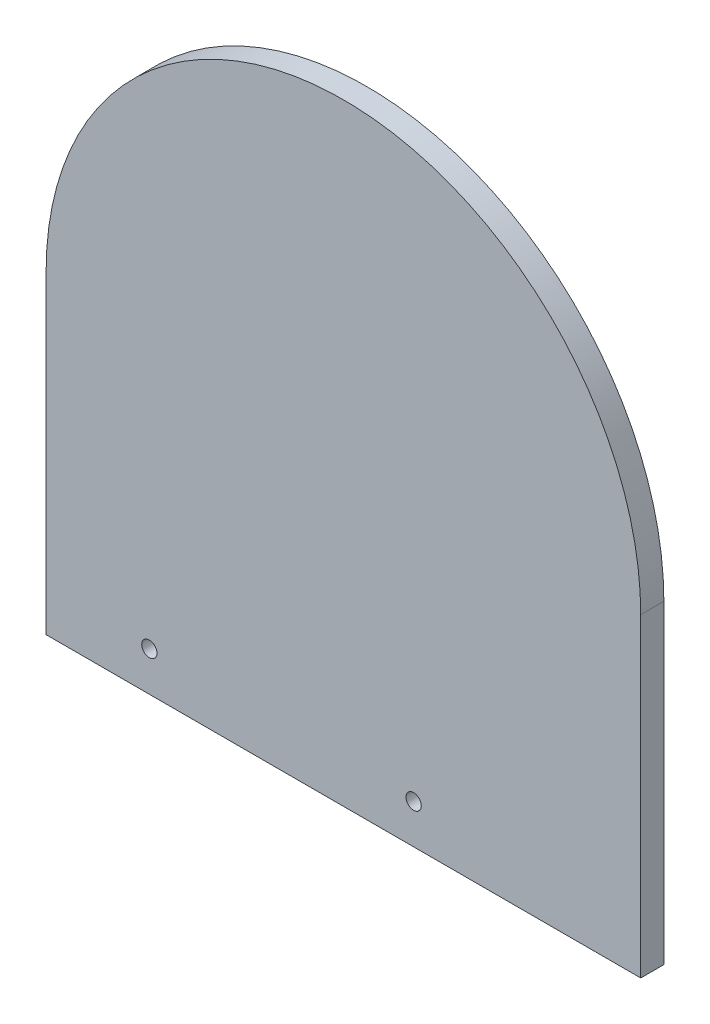
ISO-10303-21;
HEADER;
FILE_DESCRIPTION(('STEP AP214'),'2;1');
FILE_NAME('part.step','',(''),(''),'','','');
FILE_SCHEMA(('AUTOMOTIVE_DESIGN { 1 0 10303 214 1 1 1 1 }'));
ENDSEC;
DATA;
#1=APPLICATION_CONTEXT('core data for automotive mechanical design processes');
#2=APPLICATION_PROTOCOL_DEFINITION('international standard','automotive_design',2000,#1);
#3=PRODUCT_CONTEXT('',#1,'mechanical');
#4=PRODUCT('Part','Part','',(#3));
#5=PRODUCT_RELATED_PRODUCT_CATEGORY('part','',(#4));
#6=PRODUCT_DEFINITION_FORMATION('','',#4);
#7=PRODUCT_DEFINITION_CONTEXT('part definition',#1,'design');
#8=PRODUCT_DEFINITION('design','',#6,#7);
#9=PRODUCT_DEFINITION_SHAPE('','',#8);
#10=(LENGTH_UNIT() NAMED_UNIT(*) SI_UNIT(.MILLI.,.METRE.));
#11=(NAMED_UNIT(*) PLANE_ANGLE_UNIT() SI_UNIT($,.RADIAN.));
#12=(NAMED_UNIT(*) SI_UNIT($,.STERADIAN.) SOLID_ANGLE_UNIT());
#13=UNCERTAINTY_MEASURE_WITH_UNIT(LENGTH_MEASURE(1.E-05),#10,'distance_accuracy_value','');
#14=(GEOMETRIC_REPRESENTATION_CONTEXT(3) GLOBAL_UNCERTAINTY_ASSIGNED_CONTEXT((#13)) GLOBAL_UNIT_ASSIGNED_CONTEXT((#10,
#11,#12)) REPRESENTATION_CONTEXT('',''));
#15=CARTESIAN_POINT('',(0.,0.,0.));
#16=DIRECTION('',(0.,0.,1.));
#17=DIRECTION('',(1.,0.,0.));
#18=AXIS2_PLACEMENT_3D('',#15,#16,#17);
#19=CARTESIAN_POINT('',(0.,76.2,5.6));
#20=DIRECTION('',(0.,0.,-1.));
#21=DIRECTION('',(-1.,0.,0.));
#22=AXIS2_PLACEMENT_3D('',#19,#20,#21);
#23=PLANE('',#22);
#24=DIRECTION('',(0.,-1.,0.));
#25=VECTOR('',#24,1.);
#26=CARTESIAN_POINT('',(-72.,0.,5.6));
#27=LINE('',#26,#25);
#28=CARTESIAN_POINT('',(-72.,76.2,5.6));
#29=VERTEX_POINT('',#28);
#30=CARTESIAN_POINT('',(-72.,0.,5.6));
#31=VERTEX_POINT('',#30);
#32=EDGE_CURVE('E85',#29,#31,#27,.T.);
#33=ORIENTED_EDGE('',*,*,#32,.T.);
#34=DIRECTION('',(1.,0.,0.));
#35=VECTOR('',#34,1.);
#36=CARTESIAN_POINT('',(-72.,0.,5.6));
#37=LINE('',#36,#35);
#38=CARTESIAN_POINT('',(72.,0.,5.6));
#39=VERTEX_POINT('',#38);
#40=EDGE_CURVE('E80',#31,#39,#37,.T.);
#41=ORIENTED_EDGE('',*,*,#40,.T.);
#42=DIRECTION('',(0.,1.,0.));
#43=VECTOR('',#42,1.);
#44=CARTESIAN_POINT('',(72.,0.,5.6));
#45=LINE('',#44,#43);
#46=CARTESIAN_POINT('',(72.,76.2,5.6));
#47=VERTEX_POINT('',#46);
#48=EDGE_CURVE('E83',#39,#47,#45,.T.);
#49=ORIENTED_EDGE('',*,*,#48,.T.);
#50=CARTESIAN_POINT('',(0.,76.2,5.6));
#51=DIRECTION('',(0.,0.,1.));
#52=DIRECTION('',(-1.,0.,0.));
#53=AXIS2_PLACEMENT_3D('',#50,#51,#52);
#54=CIRCLE('',#53,72.);
#55=EDGE_CURVE('E50',#47,#29,#54,.T.);
#56=ORIENTED_EDGE('',*,*,#55,.T.);
#57=EDGE_LOOP('',(#33,#41,#49,#56));
#58=FACE_BOUND('',#57,.T.);
#59=CARTESIAN_POINT('',(-47.,9.525,5.6));
#60=DIRECTION('',(0.,0.,1.));
#61=DIRECTION('',(1.,0.,0.));
#62=AXIS2_PLACEMENT_3D('',#59,#60,#61);
#63=CIRCLE('',#62,1.85);
#64=CARTESIAN_POINT('',(-45.15,9.525,5.6));
#65=VERTEX_POINT('',#64);
#66=EDGE_CURVE('E100',#65,#65,#63,.T.);
#67=ORIENTED_EDGE('',*,*,#66,.F.);
#68=EDGE_LOOP('',(#67));
#69=FACE_BOUND('',#68,.T.);
#70=CARTESIAN_POINT('',(17.,9.525,5.6));
#71=DIRECTION('',(0.,0.,1.));
#72=DIRECTION('',(1.,0.,0.));
#73=AXIS2_PLACEMENT_3D('',#70,#71,#72);
#74=CIRCLE('',#73,1.85);
#75=CARTESIAN_POINT('',(18.85,9.525,5.6));
#76=VERTEX_POINT('',#75);
#77=EDGE_CURVE('E115',#76,#76,#74,.T.);
#78=ORIENTED_EDGE('',*,*,#77,.F.);
#79=EDGE_LOOP('',(#78));
#80=FACE_BOUND('',#79,.T.);
#81=ADVANCED_FACE('F33',(#58,#69,#80),#23,.F.);
#82=CARTESIAN_POINT('',(0.,76.2,0.));
#83=DIRECTION('',(0.,0.,-1.));
#84=DIRECTION('',(-1.,0.,0.));
#85=AXIS2_PLACEMENT_3D('',#82,#83,#84);
#86=PLANE('',#85);
#87=CARTESIAN_POINT('',(-47.,9.525,0.));
#88=DIRECTION('',(0.,0.,1.));
#89=DIRECTION('',(1.,0.,0.));
#90=AXIS2_PLACEMENT_3D('',#87,#88,#89);
#91=CIRCLE('',#90,1.85);
#92=CARTESIAN_POINT('',(-45.15,9.525,0.));
#93=VERTEX_POINT('',#92);
#94=EDGE_CURVE('E112',#93,#93,#91,.T.);
#95=ORIENTED_EDGE('',*,*,#94,.T.);
#96=EDGE_LOOP('',(#95));
#97=FACE_BOUND('',#96,.T.);
#98=DIRECTION('',(0.,-1.,0.));
#99=VECTOR('',#98,1.);
#100=CARTESIAN_POINT('',(-72.,0.,0.));
#101=LINE('',#100,#99);
#102=CARTESIAN_POINT('',(-72.,76.2,0.));
#103=VERTEX_POINT('',#102);
#104=CARTESIAN_POINT('',(-72.,0.,0.));
#105=VERTEX_POINT('',#104);
#106=EDGE_CURVE('E97',#103,#105,#101,.T.);
#107=ORIENTED_EDGE('',*,*,#106,.F.);
#108=CARTESIAN_POINT('',(0.,76.2,0.));
#109=DIRECTION('',(0.,0.,1.));
#110=DIRECTION('',(-1.,0.,0.));
#111=AXIS2_PLACEMENT_3D('',#108,#109,#110);
#112=CIRCLE('',#111,72.);
#113=CARTESIAN_POINT('',(72.,76.2,0.));
#114=VERTEX_POINT('',#113);
#115=EDGE_CURVE('E73',#114,#103,#112,.T.);
#116=ORIENTED_EDGE('',*,*,#115,.F.);
#117=DIRECTION('',(0.,1.,0.));
#118=VECTOR('',#117,1.);
#119=CARTESIAN_POINT('',(72.,0.,0.));
#120=LINE('',#119,#118);
#121=CARTESIAN_POINT('',(72.,0.,0.));
#122=VERTEX_POINT('',#121);
#123=EDGE_CURVE('E67',#122,#114,#120,.T.);
#124=ORIENTED_EDGE('',*,*,#123,.F.);
#125=DIRECTION('',(1.,0.,0.));
#126=VECTOR('',#125,1.);
#127=CARTESIAN_POINT('',(-72.,0.,0.));
#128=LINE('',#127,#126);
#129=EDGE_CURVE('E89',#105,#122,#128,.T.);
#130=ORIENTED_EDGE('',*,*,#129,.F.);
#131=EDGE_LOOP('',(#107,#116,#124,#130));
#132=FACE_BOUND('',#131,.T.);
#133=CARTESIAN_POINT('',(17.,9.525,0.));
#134=DIRECTION('',(0.,0.,1.));
#135=DIRECTION('',(1.,0.,0.));
#136=AXIS2_PLACEMENT_3D('',#133,#134,#135);
#137=CIRCLE('',#136,1.85);
#138=CARTESIAN_POINT('',(18.85,9.525,0.));
#139=VERTEX_POINT('',#138);
#140=EDGE_CURVE('E118',#139,#139,#137,.T.);
#141=ORIENTED_EDGE('',*,*,#140,.T.);
#142=EDGE_LOOP('',(#141));
#143=FACE_BOUND('',#142,.T.);
#144=ADVANCED_FACE('F108',(#97,#132,#143),#86,.T.);
#145=CARTESIAN_POINT('',(-72.,0.,5.6));
#146=DIRECTION('',(1.,0.,0.));
#147=DIRECTION('',(0.,0.,-1.));
#148=AXIS2_PLACEMENT_3D('',#145,#146,#147);
#149=PLANE('',#148);
#150=ORIENTED_EDGE('',*,*,#106,.T.);
#151=DIRECTION('',(0.,0.,-1.));
#152=VECTOR('',#151,1.);
#153=CARTESIAN_POINT('',(-72.,0.,5.6));
#154=LINE('',#153,#152);
#155=EDGE_CURVE('E11',#31,#105,#154,.T.);
#156=ORIENTED_EDGE('',*,*,#155,.F.);
#157=ORIENTED_EDGE('',*,*,#32,.F.);
#158=DIRECTION('',(0.,0.,-1.));
#159=VECTOR('',#158,1.);
#160=CARTESIAN_POINT('',(-72.,76.2,5.6));
#161=LINE('',#160,#159);
#162=EDGE_CURVE('E93',#29,#103,#161,.T.);
#163=ORIENTED_EDGE('',*,*,#162,.T.);
#164=EDGE_LOOP('',(#150,#156,#157,#163));
#165=FACE_BOUND('',#164,.T.);
#166=ADVANCED_FACE('F35',(#165),#149,.F.);
#167=CARTESIAN_POINT('',(-72.,0.,5.6));
#168=DIRECTION('',(0.,1.,0.));
#169=DIRECTION('',(0.,0.,1.));
#170=AXIS2_PLACEMENT_3D('',#167,#168,#169);
#171=PLANE('',#170);
#172=ORIENTED_EDGE('',*,*,#129,.T.);
#173=DIRECTION('',(0.,0.,-1.));
#174=VECTOR('',#173,1.);
#175=CARTESIAN_POINT('',(72.,0.,5.6));
#176=LINE('',#175,#174);
#177=EDGE_CURVE('E42',#39,#122,#176,.T.);
#178=ORIENTED_EDGE('',*,*,#177,.F.);
#179=ORIENTED_EDGE('',*,*,#40,.F.);
#180=ORIENTED_EDGE('',*,*,#155,.T.);
#181=EDGE_LOOP('',(#172,#178,#179,#180));
#182=FACE_BOUND('',#181,.T.);
#183=ADVANCED_FACE('F88',(#182),#171,.F.);
#184=CARTESIAN_POINT('',(72.,0.,5.6));
#185=DIRECTION('',(-1.,0.,0.));
#186=DIRECTION('',(0.,0.,1.));
#187=AXIS2_PLACEMENT_3D('',#184,#185,#186);
#188=PLANE('',#187);
#189=ORIENTED_EDGE('',*,*,#123,.T.);
#190=DIRECTION('',(0.,0.,-1.));
#191=VECTOR('',#190,1.);
#192=CARTESIAN_POINT('',(72.,76.2,5.6));
#193=LINE('',#192,#191);
#194=EDGE_CURVE('E90',#47,#114,#193,.T.);
#195=ORIENTED_EDGE('',*,*,#194,.F.);
#196=ORIENTED_EDGE('',*,*,#48,.F.);
#197=ORIENTED_EDGE('',*,*,#177,.T.);
#198=EDGE_LOOP('',(#189,#195,#196,#197));
#199=FACE_BOUND('',#198,.T.);
#200=ADVANCED_FACE('F91',(#199),#188,.F.);
#201=CARTESIAN_POINT('',(0.,76.2,5.6));
#202=DIRECTION('',(0.,0.,-1.));
#203=DIRECTION('',(-1.,0.,0.));
#204=AXIS2_PLACEMENT_3D('',#201,#202,#203);
#205=CYLINDRICAL_SURFACE('',#204,72.);
#206=ORIENTED_EDGE('',*,*,#115,.T.);
#207=ORIENTED_EDGE('',*,*,#162,.F.);
#208=ORIENTED_EDGE('',*,*,#55,.F.);
#209=ORIENTED_EDGE('',*,*,#194,.T.);
#210=EDGE_LOOP('',(#206,#207,#208,#209));
#211=FACE_BOUND('',#210,.T.);
#212=ADVANCED_FACE('F105',(#211),#205,.T.);
#213=CARTESIAN_POINT('',(-47.,9.525,5.6));
#214=DIRECTION('',(0.,0.,-1.));
#215=DIRECTION('',(-1.,0.,0.));
#216=AXIS2_PLACEMENT_3D('',#213,#214,#215);
#217=CYLINDRICAL_SURFACE('',#216,1.85);
#218=ORIENTED_EDGE('',*,*,#66,.T.);
#219=EDGE_LOOP('',(#218));
#220=FACE_BOUND('',#219,.T.);
#221=ORIENTED_EDGE('',*,*,#94,.F.);
#222=EDGE_LOOP('',(#221));
#223=FACE_BOUND('',#222,.T.);
#224=ADVANCED_FACE('F135',(#220,#223),#217,.F.);
#225=CARTESIAN_POINT('',(17.,9.525,5.6));
#226=DIRECTION('',(0.,0.,-1.));
#227=DIRECTION('',(-1.,0.,0.));
#228=AXIS2_PLACEMENT_3D('',#225,#226,#227);
#229=CYLINDRICAL_SURFACE('',#228,1.85);
#230=ORIENTED_EDGE('',*,*,#77,.T.);
#231=EDGE_LOOP('',(#230));
#232=FACE_BOUND('',#231,.T.);
#233=ORIENTED_EDGE('',*,*,#140,.F.);
#234=EDGE_LOOP('',(#233));
#235=FACE_BOUND('',#234,.T.);
#236=ADVANCED_FACE('F124',(#232,#235),#229,.F.);
#237=CLOSED_SHELL('',(#81,#144,#166,#183,#200,#212,#224,#236));
#238=MANIFOLD_SOLID_BREP('B2',#237);
#239=ADVANCED_BREP_SHAPE_REPRESENTATION('',(#18,#238),#14);
#240=SHAPE_DEFINITION_REPRESENTATION(#9,#239);
ENDSEC;
END-ISO-10303-21;
